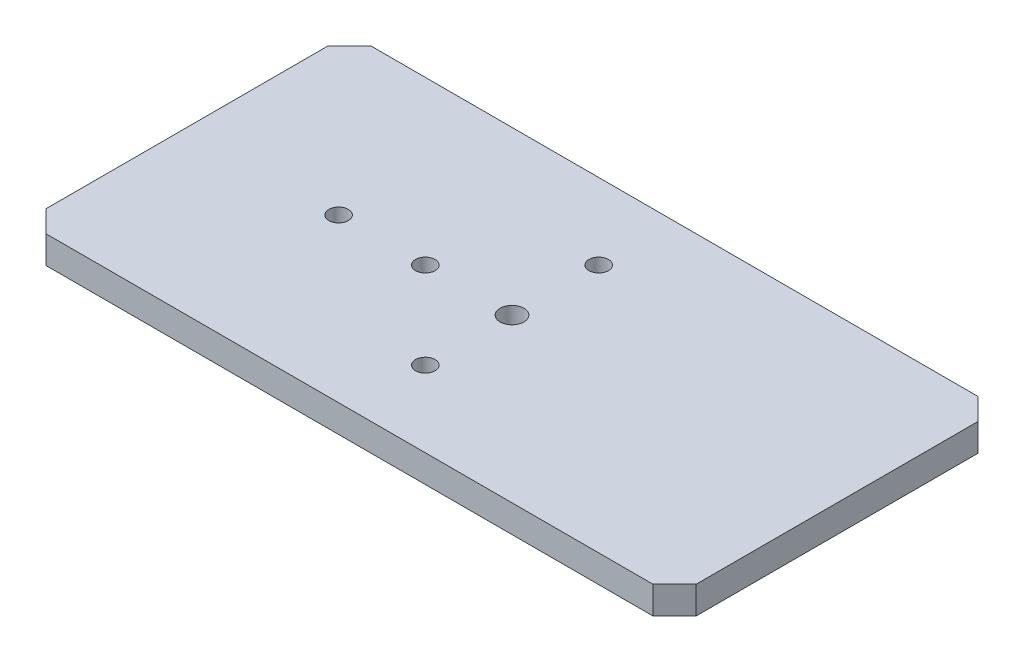
ISO-10303-21;
HEADER;
FILE_DESCRIPTION(('STEP AP214'),'2;1');
FILE_NAME('part.step','',(''),(''),'','','');
FILE_SCHEMA(('AUTOMOTIVE_DESIGN { 1 0 10303 214 1 1 1 1 }'));
ENDSEC;
DATA;
#1=APPLICATION_CONTEXT('core data for automotive mechanical design processes');
#2=APPLICATION_PROTOCOL_DEFINITION('international standard','automotive_design',2000,#1);
#3=PRODUCT_CONTEXT('',#1,'mechanical');
#4=PRODUCT('Part','Part','',(#3));
#5=PRODUCT_RELATED_PRODUCT_CATEGORY('part','',(#4));
#6=PRODUCT_DEFINITION_FORMATION('','',#4);
#7=PRODUCT_DEFINITION_CONTEXT('part definition',#1,'design');
#8=PRODUCT_DEFINITION('design','',#6,#7);
#9=PRODUCT_DEFINITION_SHAPE('','',#8);
#10=(LENGTH_UNIT() NAMED_UNIT(*) SI_UNIT(.MILLI.,.METRE.));
#11=(NAMED_UNIT(*) PLANE_ANGLE_UNIT() SI_UNIT($,.RADIAN.));
#12=(NAMED_UNIT(*) SI_UNIT($,.STERADIAN.) SOLID_ANGLE_UNIT());
#13=UNCERTAINTY_MEASURE_WITH_UNIT(LENGTH_MEASURE(1.E-05),#10,'distance_accuracy_value','');
#14=(GEOMETRIC_REPRESENTATION_CONTEXT(3) GLOBAL_UNCERTAINTY_ASSIGNED_CONTEXT((#13)) GLOBAL_UNIT_ASSIGNED_CONTEXT((#10,
#11,#12)) REPRESENTATION_CONTEXT('',''));
#15=CARTESIAN_POINT('',(0.,0.,0.));
#16=DIRECTION('',(0.,0.,1.));
#17=DIRECTION('',(1.,0.,0.));
#18=AXIS2_PLACEMENT_3D('',#15,#16,#17);
#19=CARTESIAN_POINT('',(-150.,-12.7,75.));
#20=DIRECTION('',(0.,1.,0.));
#21=DIRECTION('',(-1.,0.,0.));
#22=AXIS2_PLACEMENT_3D('',#19,#20,#21);
#23=PLANE('',#22);
#24=CARTESIAN_POINT('',(-40.,-12.7000000000001,0.));
#25=DIRECTION('',(0.,1.,0.));
#26=DIRECTION('',(0.,0.,1.));
#27=AXIS2_PLACEMENT_3D('',#24,#25,#26);
#28=CIRCLE('',#27,4.5);
#29=CARTESIAN_POINT('',(-40.,-12.7000000000001,4.5));
#30=VERTEX_POINT('',#29);
#31=EDGE_CURVE('E212',#30,#30,#28,.T.);
#32=ORIENTED_EDGE('',*,*,#31,.T.);
#33=EDGE_LOOP('',(#32));
#34=FACE_BOUND('',#33,.T.);
#35=CARTESIAN_POINT('',(0.,-12.7000000000001,40.));
#36=DIRECTION('',(0.,1.,0.));
#37=DIRECTION('',(0.,0.,1.));
#38=AXIS2_PLACEMENT_3D('',#35,#36,#37);
#39=CIRCLE('',#38,4.5);
#40=CARTESIAN_POINT('',(0.,-12.7000000000001,44.5));
#41=VERTEX_POINT('',#40);
#42=EDGE_CURVE('E206',#41,#41,#39,.T.);
#43=ORIENTED_EDGE('',*,*,#42,.T.);
#44=EDGE_LOOP('',(#43));
#45=FACE_BOUND('',#44,.T.);
#46=CARTESIAN_POINT('',(0.,-12.7000000000001,-40.));
#47=DIRECTION('',(0.,1.,0.));
#48=DIRECTION('',(0.,0.,1.));
#49=AXIS2_PLACEMENT_3D('',#46,#47,#48);
#50=CIRCLE('',#49,4.5);
#51=CARTESIAN_POINT('',(0.,-12.7000000000001,-35.5));
#52=VERTEX_POINT('',#51);
#53=EDGE_CURVE('E200',#52,#52,#50,.T.);
#54=ORIENTED_EDGE('',*,*,#53,.T.);
#55=EDGE_LOOP('',(#54));
#56=FACE_BOUND('',#55,.T.);
#57=CARTESIAN_POINT('',(-80.,-12.7000000000001,0.));
#58=DIRECTION('',(0.,1.,0.));
#59=DIRECTION('',(0.,0.,1.));
#60=AXIS2_PLACEMENT_3D('',#57,#58,#59);
#61=CIRCLE('',#60,4.5);
#62=CARTESIAN_POINT('',(-80.,-12.7000000000001,4.50000000000001));
#63=VERTEX_POINT('',#62);
#64=EDGE_CURVE('E194',#63,#63,#61,.T.);
#65=ORIENTED_EDGE('',*,*,#64,.T.);
#66=EDGE_LOOP('',(#65));
#67=FACE_BOUND('',#66,.T.);
#68=CARTESIAN_POINT('',(0.,-12.7,0.));
#69=DIRECTION('',(0.,1.,0.));
#70=DIRECTION('',(0.,0.,1.));
#71=AXIS2_PLACEMENT_3D('',#68,#69,#70);
#72=CIRCLE('',#71,5.5);
#73=CARTESIAN_POINT('',(0.,-12.7,5.5));
#74=VERTEX_POINT('',#73);
#75=EDGE_CURVE('E139',#74,#74,#72,.T.);
#76=ORIENTED_EDGE('',*,*,#75,.T.);
#77=EDGE_LOOP('',(#76));
#78=FACE_BOUND('',#77,.T.);
#79=DIRECTION('',(1.,0.,0.));
#80=VECTOR('',#79,1.);
#81=CARTESIAN_POINT('',(-150.,-12.7,-75.));
#82=LINE('',#81,#80);
#83=CARTESIAN_POINT('',(-140.,-12.7,-75.));
#84=VERTEX_POINT('',#83);
#85=CARTESIAN_POINT('',(140.,-12.6999999999999,-75.));
#86=VERTEX_POINT('',#85);
#87=EDGE_CURVE('E120',#84,#86,#82,.T.);
#88=ORIENTED_EDGE('',*,*,#87,.T.);
#89=DIRECTION('',(-0.707106781186547,0.,-0.707106781186548));
#90=VECTOR('',#89,1.);
#91=CARTESIAN_POINT('',(140.,-12.6999999999999,-75.));
#92=LINE('',#91,#90);
#93=CARTESIAN_POINT('',(150.,-12.6999999999999,-65.));
#94=VERTEX_POINT('',#93);
#95=EDGE_CURVE('E155',#86,#94,#92,.F.);
#96=ORIENTED_EDGE('',*,*,#95,.T.);
#97=DIRECTION('',(0.,0.,-1.));
#98=VECTOR('',#97,1.);
#99=CARTESIAN_POINT('',(150.,-12.6999999999999,75.));
#100=LINE('',#99,#98);
#101=CARTESIAN_POINT('',(150.,-12.6999999999999,65.));
#102=VERTEX_POINT('',#101);
#103=EDGE_CURVE('E142',#102,#94,#100,.T.);
#104=ORIENTED_EDGE('',*,*,#103,.F.);
#105=DIRECTION('',(-0.707106781186549,0.,0.707106781186546));
#106=VECTOR('',#105,1.);
#107=CARTESIAN_POINT('',(150.,-12.6999999999999,65.));
#108=LINE('',#107,#106);
#109=CARTESIAN_POINT('',(140.,-12.6999999999999,75.));
#110=VERTEX_POINT('',#109);
#111=EDGE_CURVE('E153',#102,#110,#108,.T.);
#112=ORIENTED_EDGE('',*,*,#111,.T.);
#113=DIRECTION('',(1.,0.,0.));
#114=VECTOR('',#113,1.);
#115=CARTESIAN_POINT('',(-150.,-12.7,75.));
#116=LINE('',#115,#114);
#117=CARTESIAN_POINT('',(-140.,-12.7,75.));
#118=VERTEX_POINT('',#117);
#119=EDGE_CURVE('E185',#118,#110,#116,.T.);
#120=ORIENTED_EDGE('',*,*,#119,.F.);
#121=DIRECTION('',(-0.707106781186549,0.,-0.707106781186546));
#122=VECTOR('',#121,1.);
#123=CARTESIAN_POINT('',(-150.,-12.7,65.));
#124=LINE('',#123,#122);
#125=CARTESIAN_POINT('',(-150.,-12.7,65.));
#126=VERTEX_POINT('',#125);
#127=EDGE_CURVE('E126',#118,#126,#124,.T.);
#128=ORIENTED_EDGE('',*,*,#127,.T.);
#129=DIRECTION('',(0.,0.,-1.));
#130=VECTOR('',#129,1.);
#131=CARTESIAN_POINT('',(-150.,-12.7,75.));
#132=LINE('',#131,#130);
#133=CARTESIAN_POINT('',(-150.,-12.7,-65.));
#134=VERTEX_POINT('',#133);
#135=EDGE_CURVE('E122',#126,#134,#132,.T.);
#136=ORIENTED_EDGE('',*,*,#135,.T.);
#137=DIRECTION('',(-0.707106781186547,0.,0.707106781186548));
#138=VECTOR('',#137,1.);
#139=CARTESIAN_POINT('',(-140.,-12.7,-75.));
#140=LINE('',#139,#138);
#141=EDGE_CURVE('E118',#134,#84,#140,.F.);
#142=ORIENTED_EDGE('',*,*,#141,.T.);
#143=EDGE_LOOP('',(#88,#96,#104,#112,#120,#128,#136,#142));
#144=FACE_BOUND('',#143,.T.);
#145=ADVANCED_FACE('F47',(#34,#45,#56,#67,#78,#144),#23,.F.);
#146=CARTESIAN_POINT('',(150.,0.,75.));
#147=DIRECTION('',(1.,0.,0.));
#148=DIRECTION('',(0.,0.,-1.));
#149=AXIS2_PLACEMENT_3D('',#146,#147,#148);
#150=PLANE('',#149);
#151=ORIENTED_EDGE('',*,*,#103,.T.);
#152=DIRECTION('',(0.,1.,0.));
#153=VECTOR('',#152,1.);
#154=CARTESIAN_POINT('',(150.,0.,-65.));
#155=LINE('',#154,#153);
#156=CARTESIAN_POINT('',(150.,0.,-65.));
#157=VERTEX_POINT('',#156);
#158=EDGE_CURVE('E161',#94,#157,#155,.T.);
#159=ORIENTED_EDGE('',*,*,#158,.T.);
#160=DIRECTION('',(0.,0.,-1.));
#161=VECTOR('',#160,1.);
#162=CARTESIAN_POINT('',(150.,0.,75.));
#163=LINE('',#162,#161);
#164=CARTESIAN_POINT('',(150.,0.,65.));
#165=VERTEX_POINT('',#164);
#166=EDGE_CURVE('E148',#165,#157,#163,.T.);
#167=ORIENTED_EDGE('',*,*,#166,.F.);
#168=DIRECTION('',(0.,-1.,0.));
#169=VECTOR('',#168,1.);
#170=CARTESIAN_POINT('',(150.,-12.6999999999999,65.));
#171=LINE('',#170,#169);
#172=EDGE_CURVE('E158',#165,#102,#171,.T.);
#173=ORIENTED_EDGE('',*,*,#172,.T.);
#174=EDGE_LOOP('',(#151,#159,#167,#173));
#175=FACE_BOUND('',#174,.T.);
#176=ADVANCED_FACE('F224',(#175),#150,.T.);
#177=CARTESIAN_POINT('',(-150.,0.,75.));
#178=DIRECTION('',(0.,1.,0.));
#179=DIRECTION('',(-1.,0.,0.));
#180=AXIS2_PLACEMENT_3D('',#177,#178,#179);
#181=PLANE('',#180);
#182=CARTESIAN_POINT('',(-40.,0.,0.));
#183=DIRECTION('',(0.,1.,0.));
#184=DIRECTION('',(0.,0.,1.));
#185=AXIS2_PLACEMENT_3D('',#182,#183,#184);
#186=CIRCLE('',#185,4.5);
#187=CARTESIAN_POINT('',(-40.,0.,4.5));
#188=VERTEX_POINT('',#187);
#189=EDGE_CURVE('E215',#188,#188,#186,.T.);
#190=ORIENTED_EDGE('',*,*,#189,.F.);
#191=EDGE_LOOP('',(#190));
#192=FACE_BOUND('',#191,.T.);
#193=CARTESIAN_POINT('',(0.,0.,40.));
#194=DIRECTION('',(0.,1.,0.));
#195=DIRECTION('',(0.,0.,1.));
#196=AXIS2_PLACEMENT_3D('',#193,#194,#195);
#197=CIRCLE('',#196,4.5);
#198=CARTESIAN_POINT('',(0.,0.,44.5));
#199=VERTEX_POINT('',#198);
#200=EDGE_CURVE('E209',#199,#199,#197,.T.);
#201=ORIENTED_EDGE('',*,*,#200,.F.);
#202=EDGE_LOOP('',(#201));
#203=FACE_BOUND('',#202,.T.);
#204=CARTESIAN_POINT('',(0.,0.,-40.));
#205=DIRECTION('',(0.,1.,0.));
#206=DIRECTION('',(0.,0.,1.));
#207=AXIS2_PLACEMENT_3D('',#204,#205,#206);
#208=CIRCLE('',#207,4.5);
#209=CARTESIAN_POINT('',(0.,0.,-35.5));
#210=VERTEX_POINT('',#209);
#211=EDGE_CURVE('E203',#210,#210,#208,.T.);
#212=ORIENTED_EDGE('',*,*,#211,.F.);
#213=EDGE_LOOP('',(#212));
#214=FACE_BOUND('',#213,.T.);
#215=CARTESIAN_POINT('',(-80.,0.,0.));
#216=DIRECTION('',(0.,1.,0.));
#217=DIRECTION('',(0.,0.,1.));
#218=AXIS2_PLACEMENT_3D('',#215,#216,#217);
#219=CIRCLE('',#218,4.5);
#220=CARTESIAN_POINT('',(-80.,0.,4.50000000000001));
#221=VERTEX_POINT('',#220);
#222=EDGE_CURVE('E197',#221,#221,#219,.T.);
#223=ORIENTED_EDGE('',*,*,#222,.F.);
#224=EDGE_LOOP('',(#223));
#225=FACE_BOUND('',#224,.T.);
#226=CARTESIAN_POINT('',(0.,0.,0.));
#227=DIRECTION('',(0.,1.,0.));
#228=DIRECTION('',(0.,0.,1.));
#229=AXIS2_PLACEMENT_3D('',#226,#227,#228);
#230=CIRCLE('',#229,5.5);
#231=CARTESIAN_POINT('',(0.,0.,5.5));
#232=VERTEX_POINT('',#231);
#233=EDGE_CURVE('E191',#232,#232,#230,.T.);
#234=ORIENTED_EDGE('',*,*,#233,.F.);
#235=EDGE_LOOP('',(#234));
#236=FACE_BOUND('',#235,.T.);
#237=ORIENTED_EDGE('',*,*,#166,.T.);
#238=DIRECTION('',(0.707106781186547,0.,0.707106781186548));
#239=VECTOR('',#238,1.);
#240=CARTESIAN_POINT('',(70.0000000000004,0.,-145.));
#241=LINE('',#240,#239);
#242=CARTESIAN_POINT('',(140.,0.,-75.));
#243=VERTEX_POINT('',#242);
#244=EDGE_CURVE('E168',#157,#243,#241,.F.);
#245=ORIENTED_EDGE('',*,*,#244,.T.);
#246=DIRECTION('',(1.,0.,0.));
#247=VECTOR('',#246,1.);
#248=CARTESIAN_POINT('',(-150.,0.,-75.));
#249=LINE('',#248,#247);
#250=CARTESIAN_POINT('',(-140.,0.,-75.));
#251=VERTEX_POINT('',#250);
#252=EDGE_CURVE('E138',#251,#243,#249,.T.);
#253=ORIENTED_EDGE('',*,*,#252,.F.);
#254=DIRECTION('',(0.707106781186547,0.,-0.707106781186548));
#255=VECTOR('',#254,1.);
#256=CARTESIAN_POINT('',(-220.,0.,5.00000000000017));
#257=LINE('',#256,#255);
#258=CARTESIAN_POINT('',(-150.,0.,-65.));
#259=VERTEX_POINT('',#258);
#260=EDGE_CURVE('E141',#251,#259,#257,.F.);
#261=ORIENTED_EDGE('',*,*,#260,.T.);
#262=DIRECTION('',(0.,0.,-1.));
#263=VECTOR('',#262,1.);
#264=CARTESIAN_POINT('',(-150.,0.,75.));
#265=LINE('',#264,#263);
#266=CARTESIAN_POINT('',(-150.,0.,65.));
#267=VERTEX_POINT('',#266);
#268=EDGE_CURVE('E177',#267,#259,#265,.T.);
#269=ORIENTED_EDGE('',*,*,#268,.F.);
#270=DIRECTION('',(0.707106781186549,0.,0.707106781186546));
#271=VECTOR('',#270,1.);
#272=CARTESIAN_POINT('',(-145.,0.,70.));
#273=LINE('',#272,#271);
#274=CARTESIAN_POINT('',(-140.,0.,75.));
#275=VERTEX_POINT('',#274);
#276=EDGE_CURVE('E69',#267,#275,#273,.T.);
#277=ORIENTED_EDGE('',*,*,#276,.T.);
#278=DIRECTION('',(1.,0.,0.));
#279=VECTOR('',#278,1.);
#280=CARTESIAN_POINT('',(-150.,0.,75.));
#281=LINE('',#280,#279);
#282=CARTESIAN_POINT('',(140.,0.,75.));
#283=VERTEX_POINT('',#282);
#284=EDGE_CURVE('E181',#275,#283,#281,.T.);
#285=ORIENTED_EDGE('',*,*,#284,.T.);
#286=DIRECTION('',(0.707106781186549,0.,-0.707106781186546));
#287=VECTOR('',#286,1.);
#288=CARTESIAN_POINT('',(-5.00000000000081,0.,220.));
#289=LINE('',#288,#287);
#290=EDGE_CURVE('E166',#283,#165,#289,.T.);
#291=ORIENTED_EDGE('',*,*,#290,.T.);
#292=EDGE_LOOP('',(#237,#245,#253,#261,#269,#277,#285,#291));
#293=FACE_BOUND('',#292,.T.);
#294=ADVANCED_FACE('F221',(#192,#203,#214,#225,#236,#293),#181,.T.);
#295=CARTESIAN_POINT('',(-150.,-12.7,75.));
#296=DIRECTION('',(-1.,0.,0.));
#297=DIRECTION('',(0.,0.,1.));
#298=AXIS2_PLACEMENT_3D('',#295,#296,#297);
#299=PLANE('',#298);
#300=ORIENTED_EDGE('',*,*,#135,.F.);
#301=DIRECTION('',(0.,1.,0.));
#302=VECTOR('',#301,1.);
#303=CARTESIAN_POINT('',(-150.,0.,65.));
#304=LINE('',#303,#302);
#305=EDGE_CURVE('E11',#126,#267,#304,.T.);
#306=ORIENTED_EDGE('',*,*,#305,.T.);
#307=ORIENTED_EDGE('',*,*,#268,.T.);
#308=DIRECTION('',(0.,-1.,0.));
#309=VECTOR('',#308,1.);
#310=CARTESIAN_POINT('',(-150.,-12.7,-65.));
#311=LINE('',#310,#309);
#312=EDGE_CURVE('E55',#259,#134,#311,.T.);
#313=ORIENTED_EDGE('',*,*,#312,.T.);
#314=EDGE_LOOP('',(#300,#306,#307,#313));
#315=FACE_BOUND('',#314,.T.);
#316=ADVANCED_FACE('F175',(#315),#299,.T.);
#317=CARTESIAN_POINT('',(0.,0.,75.));
#318=DIRECTION('',(0.,0.,-1.));
#319=DIRECTION('',(-1.,0.,0.));
#320=AXIS2_PLACEMENT_3D('',#317,#318,#319);
#321=PLANE('',#320);
#322=ORIENTED_EDGE('',*,*,#119,.T.);
#323=DIRECTION('',(0.,1.,0.));
#324=VECTOR('',#323,1.);
#325=CARTESIAN_POINT('',(140.,0.,75.));
#326=LINE('',#325,#324);
#327=EDGE_CURVE('E62',#110,#283,#326,.T.);
#328=ORIENTED_EDGE('',*,*,#327,.T.);
#329=ORIENTED_EDGE('',*,*,#284,.F.);
#330=DIRECTION('',(0.,-1.,0.));
#331=VECTOR('',#330,1.);
#332=CARTESIAN_POINT('',(-140.,-12.7,75.));
#333=LINE('',#332,#331);
#334=EDGE_CURVE('E171',#275,#118,#333,.T.);
#335=ORIENTED_EDGE('',*,*,#334,.T.);
#336=EDGE_LOOP('',(#322,#328,#329,#335));
#337=FACE_BOUND('',#336,.T.);
#338=ADVANCED_FACE('F246',(#337),#321,.F.);
#339=CARTESIAN_POINT('',(0.,0.,-75.));
#340=DIRECTION('',(0.,0.,-1.));
#341=DIRECTION('',(-1.,0.,0.));
#342=AXIS2_PLACEMENT_3D('',#339,#340,#341);
#343=PLANE('',#342);
#344=ORIENTED_EDGE('',*,*,#252,.T.);
#345=DIRECTION('',(0.,-1.,0.));
#346=VECTOR('',#345,1.);
#347=CARTESIAN_POINT('',(140.,0.,-75.));
#348=LINE('',#347,#346);
#349=EDGE_CURVE('E127',#243,#86,#348,.T.);
#350=ORIENTED_EDGE('',*,*,#349,.T.);
#351=ORIENTED_EDGE('',*,*,#87,.F.);
#352=DIRECTION('',(0.,1.,0.));
#353=VECTOR('',#352,1.);
#354=CARTESIAN_POINT('',(-140.,0.,-75.));
#355=LINE('',#354,#353);
#356=EDGE_CURVE('E134',#84,#251,#355,.T.);
#357=ORIENTED_EDGE('',*,*,#356,.T.);
#358=EDGE_LOOP('',(#344,#350,#351,#357));
#359=FACE_BOUND('',#358,.T.);
#360=ADVANCED_FACE('F133',(#359),#343,.T.);
#361=CARTESIAN_POINT('',(0.,0.,0.));
#362=DIRECTION('',(0.,1.,0.));
#363=DIRECTION('',(0.,0.,1.));
#364=AXIS2_PLACEMENT_3D('',#361,#362,#363);
#365=CYLINDRICAL_SURFACE('',#364,5.5);
#366=ORIENTED_EDGE('',*,*,#75,.F.);
#367=EDGE_LOOP('',(#366));
#368=FACE_BOUND('',#367,.T.);
#369=ORIENTED_EDGE('',*,*,#233,.T.);
#370=EDGE_LOOP('',(#369));
#371=FACE_BOUND('',#370,.T.);
#372=ADVANCED_FACE('F287',(#368,#371),#365,.F.);
#373=CARTESIAN_POINT('',(-80.,0.,0.));
#374=DIRECTION('',(0.,1.,0.));
#375=DIRECTION('',(0.,0.,1.));
#376=AXIS2_PLACEMENT_3D('',#373,#374,#375);
#377=CYLINDRICAL_SURFACE('',#376,4.5);
#378=ORIENTED_EDGE('',*,*,#64,.F.);
#379=EDGE_LOOP('',(#378));
#380=FACE_BOUND('',#379,.T.);
#381=ORIENTED_EDGE('',*,*,#222,.T.);
#382=EDGE_LOOP('',(#381));
#383=FACE_BOUND('',#382,.T.);
#384=ADVANCED_FACE('F283',(#380,#383),#377,.F.);
#385=CARTESIAN_POINT('',(0.,0.,-40.));
#386=DIRECTION('',(0.,1.,0.));
#387=DIRECTION('',(0.,0.,1.));
#388=AXIS2_PLACEMENT_3D('',#385,#386,#387);
#389=CYLINDRICAL_SURFACE('',#388,4.5);
#390=ORIENTED_EDGE('',*,*,#53,.F.);
#391=EDGE_LOOP('',(#390));
#392=FACE_BOUND('',#391,.T.);
#393=ORIENTED_EDGE('',*,*,#211,.T.);
#394=EDGE_LOOP('',(#393));
#395=FACE_BOUND('',#394,.T.);
#396=ADVANCED_FACE('F276',(#392,#395),#389,.F.);
#397=CARTESIAN_POINT('',(0.,0.,40.));
#398=DIRECTION('',(0.,1.,0.));
#399=DIRECTION('',(0.,0.,1.));
#400=AXIS2_PLACEMENT_3D('',#397,#398,#399);
#401=CYLINDRICAL_SURFACE('',#400,4.5);
#402=ORIENTED_EDGE('',*,*,#42,.F.);
#403=EDGE_LOOP('',(#402));
#404=FACE_BOUND('',#403,.T.);
#405=ORIENTED_EDGE('',*,*,#200,.T.);
#406=EDGE_LOOP('',(#405));
#407=FACE_BOUND('',#406,.T.);
#408=ADVANCED_FACE('F270',(#404,#407),#401,.F.);
#409=CARTESIAN_POINT('',(-40.,0.,0.));
#410=DIRECTION('',(0.,1.,0.));
#411=DIRECTION('',(0.,0.,1.));
#412=AXIS2_PLACEMENT_3D('',#409,#410,#411);
#413=CYLINDRICAL_SURFACE('',#412,4.5);
#414=ORIENTED_EDGE('',*,*,#31,.F.);
#415=EDGE_LOOP('',(#414));
#416=FACE_BOUND('',#415,.T.);
#417=ORIENTED_EDGE('',*,*,#189,.T.);
#418=EDGE_LOOP('',(#417));
#419=FACE_BOUND('',#418,.T.);
#420=ADVANCED_FACE('F219',(#416,#419),#413,.F.);
#421=CARTESIAN_POINT('',(140.,0.,-75.));
#422=DIRECTION('',(-0.707106781186548,0.,0.707106781186547));
#423=DIRECTION('',(0.,-1.,0.));
#424=AXIS2_PLACEMENT_3D('',#421,#422,#423);
#425=PLANE('',#424);
#426=ORIENTED_EDGE('',*,*,#244,.F.);
#427=ORIENTED_EDGE('',*,*,#158,.F.);
#428=ORIENTED_EDGE('',*,*,#95,.F.);
#429=ORIENTED_EDGE('',*,*,#349,.F.);
#430=EDGE_LOOP('',(#426,#427,#428,#429));
#431=FACE_BOUND('',#430,.T.);
#432=ADVANCED_FACE('F240',(#431),#425,.F.);
#433=CARTESIAN_POINT('',(150.,0.,65.));
#434=DIRECTION('',(0.707106781186545,0.,0.707106781186549));
#435=DIRECTION('',(0.,1.,0.));
#436=AXIS2_PLACEMENT_3D('',#433,#434,#435);
#437=PLANE('',#436);
#438=ORIENTED_EDGE('',*,*,#290,.F.);
#439=ORIENTED_EDGE('',*,*,#327,.F.);
#440=ORIENTED_EDGE('',*,*,#111,.F.);
#441=ORIENTED_EDGE('',*,*,#172,.F.);
#442=EDGE_LOOP('',(#438,#439,#440,#441));
#443=FACE_BOUND('',#442,.T.);
#444=ADVANCED_FACE('F243',(#443),#437,.T.);
#445=CARTESIAN_POINT('',(-150.,-12.7,65.));
#446=DIRECTION('',(-0.707106781186545,0.,0.707106781186549));
#447=DIRECTION('',(0.,-1.,0.));
#448=AXIS2_PLACEMENT_3D('',#445,#446,#447);
#449=PLANE('',#448);
#450=ORIENTED_EDGE('',*,*,#127,.F.);
#451=ORIENTED_EDGE('',*,*,#334,.F.);
#452=ORIENTED_EDGE('',*,*,#276,.F.);
#453=ORIENTED_EDGE('',*,*,#305,.F.);
#454=EDGE_LOOP('',(#450,#451,#452,#453));
#455=FACE_BOUND('',#454,.T.);
#456=ADVANCED_FACE('F249',(#455),#449,.T.);
#457=CARTESIAN_POINT('',(-140.,0.,-75.));
#458=DIRECTION('',(0.707106781186548,0.,0.707106781186547));
#459=DIRECTION('',(0.,1.,0.));
#460=AXIS2_PLACEMENT_3D('',#457,#458,#459);
#461=PLANE('',#460);
#462=ORIENTED_EDGE('',*,*,#141,.F.);
#463=ORIENTED_EDGE('',*,*,#312,.F.);
#464=ORIENTED_EDGE('',*,*,#260,.F.);
#465=ORIENTED_EDGE('',*,*,#356,.F.);
#466=EDGE_LOOP('',(#462,#463,#464,#465));
#467=FACE_BOUND('',#466,.T.);
#468=ADVANCED_FACE('F49',(#467),#461,.F.);
#469=CLOSED_SHELL('',(#145,#176,#294,#316,#338,#360,#372,#384,#396,#408,#420,#432,#444,#456,#468));
#470=MANIFOLD_SOLID_BREP('B2',#469);
#471=ADVANCED_BREP_SHAPE_REPRESENTATION('',(#18,#470),#14);
#472=SHAPE_DEFINITION_REPRESENTATION(#9,#471);
ENDSEC;
END-ISO-10303-21;
